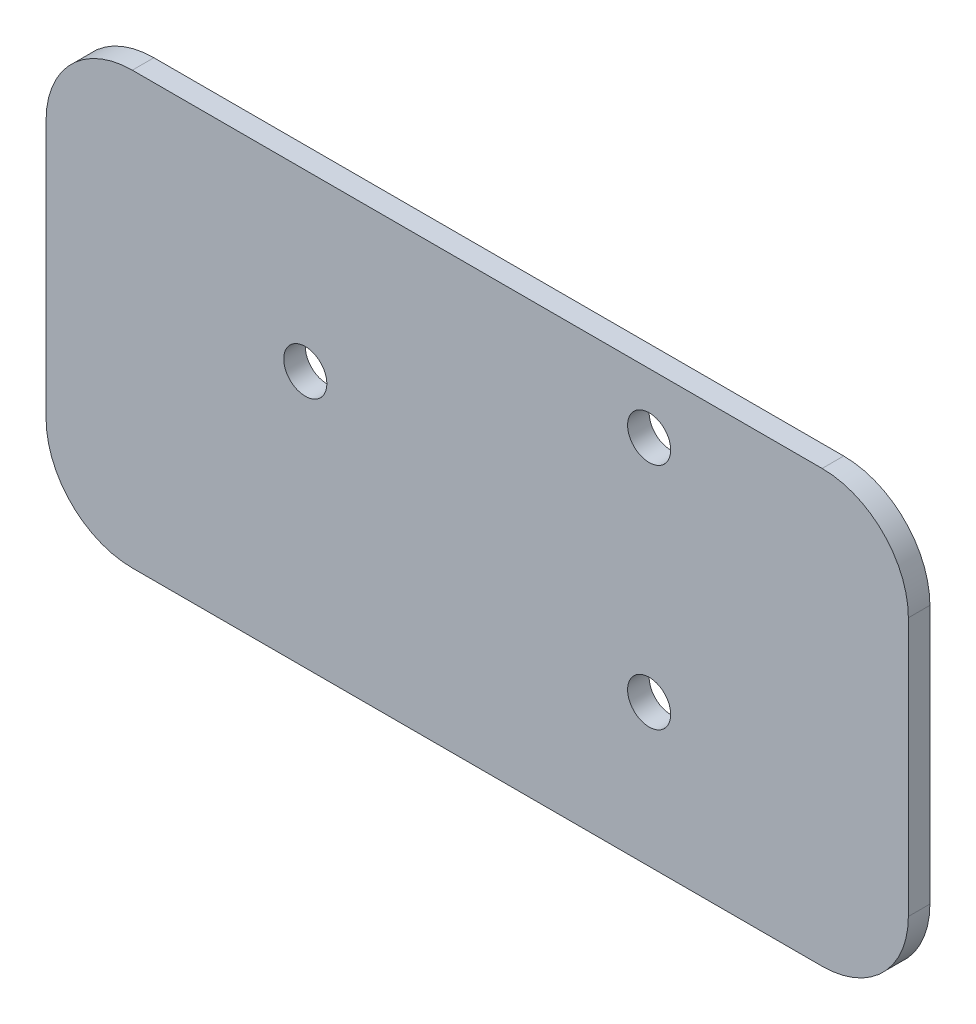
ISO-10303-21;
HEADER;
FILE_DESCRIPTION(('STEP AP214'),'2;1');
FILE_NAME('part.step','',(''),(''),'','','');
FILE_SCHEMA(('AUTOMOTIVE_DESIGN { 1 0 10303 214 1 1 1 1 }'));
ENDSEC;
DATA;
#1=APPLICATION_CONTEXT('core data for automotive mechanical design processes');
#2=APPLICATION_PROTOCOL_DEFINITION('international standard','automotive_design',2000,#1);
#3=PRODUCT_CONTEXT('',#1,'mechanical');
#4=PRODUCT('Part','Part','',(#3));
#5=PRODUCT_RELATED_PRODUCT_CATEGORY('part','',(#4));
#6=PRODUCT_DEFINITION_FORMATION('','',#4);
#7=PRODUCT_DEFINITION_CONTEXT('part definition',#1,'design');
#8=PRODUCT_DEFINITION('design','',#6,#7);
#9=PRODUCT_DEFINITION_SHAPE('','',#8);
#10=(LENGTH_UNIT() NAMED_UNIT(*) SI_UNIT(.MILLI.,.METRE.));
#11=(NAMED_UNIT(*) PLANE_ANGLE_UNIT() SI_UNIT($,.RADIAN.));
#12=(NAMED_UNIT(*) SI_UNIT($,.STERADIAN.) SOLID_ANGLE_UNIT());
#13=UNCERTAINTY_MEASURE_WITH_UNIT(LENGTH_MEASURE(1.E-05),#10,'distance_accuracy_value','');
#14=(GEOMETRIC_REPRESENTATION_CONTEXT(3) GLOBAL_UNCERTAINTY_ASSIGNED_CONTEXT((#13)) GLOBAL_UNIT_ASSIGNED_CONTEXT((#10,
#11,#12)) REPRESENTATION_CONTEXT('',''));
#15=CARTESIAN_POINT('',(0.,0.,0.));
#16=DIRECTION('',(0.,0.,1.));
#17=DIRECTION('',(1.,0.,0.));
#18=AXIS2_PLACEMENT_3D('',#15,#16,#17);
#19=CARTESIAN_POINT('',(0.,139.055716341249,3.175));
#20=DIRECTION('',(0.,1.,0.));
#21=DIRECTION('',(0.,0.,1.));
#22=AXIS2_PLACEMENT_3D('',#19,#20,#21);
#23=PLANE('',#22);
#24=DIRECTION('',(1.,0.,0.));
#25=VECTOR('',#24,1.);
#26=CARTESIAN_POINT('',(0.,139.055716341249,0.));
#27=LINE('',#26,#25);
#28=CARTESIAN_POINT('',(409.779351392055,139.055716341249,0.));
#29=VERTEX_POINT('',#28);
#30=CARTESIAN_POINT('',(511.379351392055,139.055716341249,0.));
#31=VERTEX_POINT('',#30);
#32=EDGE_CURVE('E139',#29,#31,#27,.T.);
#33=ORIENTED_EDGE('',*,*,#32,.F.);
#34=DIRECTION('',(0.,0.,-1.));
#35=VECTOR('',#34,1.);
#36=CARTESIAN_POINT('',(409.779351392055,139.055716341249,3.175));
#37=LINE('',#36,#35);
#38=CARTESIAN_POINT('',(409.779351392055,139.055716341249,3.175));
#39=VERTEX_POINT('',#38);
#40=EDGE_CURVE('E11',#39,#29,#37,.T.);
#41=ORIENTED_EDGE('',*,*,#40,.F.);
#42=DIRECTION('',(1.,0.,0.));
#43=VECTOR('',#42,1.);
#44=CARTESIAN_POINT('',(0.,139.055716341249,3.175));
#45=LINE('',#44,#43);
#46=CARTESIAN_POINT('',(511.379351392055,139.055716341249,3.175));
#47=VERTEX_POINT('',#46);
#48=EDGE_CURVE('E311',#39,#47,#45,.T.);
#49=ORIENTED_EDGE('',*,*,#48,.T.);
#50=DIRECTION('',(0.,0.,-1.));
#51=VECTOR('',#50,1.);
#52=CARTESIAN_POINT('',(511.379351392055,139.055716341249,3.175));
#53=LINE('',#52,#51);
#54=EDGE_CURVE('E53',#47,#31,#53,.T.);
#55=ORIENTED_EDGE('',*,*,#54,.T.);
#56=EDGE_LOOP('',(#33,#41,#49,#55));
#57=FACE_BOUND('',#56,.T.);
#58=ADVANCED_FACE('F36',(#57),#23,.T.);
#59=CARTESIAN_POINT('',(409.779351392055,126.355716341249,3.175));
#60=DIRECTION('',(0.,0.,-1.));
#61=DIRECTION('',(-1.,0.,0.));
#62=AXIS2_PLACEMENT_3D('',#59,#60,#61);
#63=CYLINDRICAL_SURFACE('',#62,12.7);
#64=CARTESIAN_POINT('',(409.779351392055,126.355716341249,0.));
#65=DIRECTION('',(0.,0.,1.));
#66=DIRECTION('',(1.,0.,0.));
#67=AXIS2_PLACEMENT_3D('',#64,#65,#66);
#68=CIRCLE('',#67,12.7);
#69=CARTESIAN_POINT('',(397.079351392055,126.355716341249,0.));
#70=VERTEX_POINT('',#69);
#71=EDGE_CURVE('E141',#29,#70,#68,.T.);
#72=ORIENTED_EDGE('',*,*,#71,.T.);
#73=DIRECTION('',(0.,0.,-1.));
#74=VECTOR('',#73,1.);
#75=CARTESIAN_POINT('',(397.079351392055,126.355716341249,3.175));
#76=LINE('',#75,#74);
#77=CARTESIAN_POINT('',(397.079351392055,126.355716341249,3.175));
#78=VERTEX_POINT('',#77);
#79=EDGE_CURVE('E45',#78,#70,#76,.T.);
#80=ORIENTED_EDGE('',*,*,#79,.F.);
#81=CARTESIAN_POINT('',(409.779351392055,126.355716341249,3.175));
#82=DIRECTION('',(0.,0.,1.));
#83=DIRECTION('',(1.,0.,0.));
#84=AXIS2_PLACEMENT_3D('',#81,#82,#83);
#85=CIRCLE('',#84,12.7);
#86=EDGE_CURVE('E307',#39,#78,#85,.T.);
#87=ORIENTED_EDGE('',*,*,#86,.F.);
#88=ORIENTED_EDGE('',*,*,#40,.T.);
#89=EDGE_LOOP('',(#72,#80,#87,#88));
#90=FACE_BOUND('',#89,.T.);
#91=ADVANCED_FACE('F178',(#90),#63,.T.);
#92=CARTESIAN_POINT('',(397.079351392055,5.78538895693811E-13,3.175));
#93=DIRECTION('',(1.,0.,0.));
#94=DIRECTION('',(0.,1.,0.));
#95=AXIS2_PLACEMENT_3D('',#92,#93,#94);
#96=PLANE('',#95);
#97=DIRECTION('',(0.,-1.,0.));
#98=VECTOR('',#97,1.);
#99=CARTESIAN_POINT('',(397.079351392055,5.78538895693811E-13,0.));
#100=LINE('',#99,#98);
#101=CARTESIAN_POINT('',(397.079351392055,88.2557163412488,0.));
#102=VERTEX_POINT('',#101);
#103=EDGE_CURVE('E144',#70,#102,#100,.T.);
#104=ORIENTED_EDGE('',*,*,#103,.T.);
#105=DIRECTION('',(0.,0.,-1.));
#106=VECTOR('',#105,1.);
#107=CARTESIAN_POINT('',(397.079351392055,88.2557163412488,3.175));
#108=LINE('',#107,#106);
#109=CARTESIAN_POINT('',(397.079351392055,88.2557163412488,3.175));
#110=VERTEX_POINT('',#109);
#111=EDGE_CURVE('E166',#110,#102,#108,.T.);
#112=ORIENTED_EDGE('',*,*,#111,.F.);
#113=DIRECTION('',(0.,-1.,0.));
#114=VECTOR('',#113,1.);
#115=CARTESIAN_POINT('',(397.079351392055,5.78538895693811E-13,3.175));
#116=LINE('',#115,#114);
#117=EDGE_CURVE('E174',#78,#110,#116,.T.);
#118=ORIENTED_EDGE('',*,*,#117,.F.);
#119=ORIENTED_EDGE('',*,*,#79,.T.);
#120=EDGE_LOOP('',(#104,#112,#118,#119));
#121=FACE_BOUND('',#120,.T.);
#122=ADVANCED_FACE('F171',(#121),#96,.F.);
#123=CARTESIAN_POINT('',(409.779351392055,88.2557163412488,3.175));
#124=DIRECTION('',(0.,0.,-1.));
#125=DIRECTION('',(-1.,0.,0.));
#126=AXIS2_PLACEMENT_3D('',#123,#124,#125);
#127=CYLINDRICAL_SURFACE('',#126,12.7);
#128=CARTESIAN_POINT('',(409.779351392055,88.2557163412488,0.));
#129=DIRECTION('',(0.,0.,1.));
#130=DIRECTION('',(1.,0.,0.));
#131=AXIS2_PLACEMENT_3D('',#128,#129,#130);
#132=CIRCLE('',#131,12.7);
#133=CARTESIAN_POINT('',(409.779351392055,75.5557163412488,0.));
#134=VERTEX_POINT('',#133);
#135=EDGE_CURVE('E147',#102,#134,#132,.T.);
#136=ORIENTED_EDGE('',*,*,#135,.T.);
#137=DIRECTION('',(0.,0.,-1.));
#138=VECTOR('',#137,1.);
#139=CARTESIAN_POINT('',(409.779351392055,75.5557163412488,3.175));
#140=LINE('',#139,#138);
#141=CARTESIAN_POINT('',(409.779351392055,75.5557163412488,3.175));
#142=VERTEX_POINT('',#141);
#143=EDGE_CURVE('E163',#142,#134,#140,.T.);
#144=ORIENTED_EDGE('',*,*,#143,.F.);
#145=CARTESIAN_POINT('',(409.779351392055,88.2557163412488,3.175));
#146=DIRECTION('',(0.,0.,1.));
#147=DIRECTION('',(1.,0.,0.));
#148=AXIS2_PLACEMENT_3D('',#145,#146,#147);
#149=CIRCLE('',#148,12.7);
#150=EDGE_CURVE('E305',#110,#142,#149,.T.);
#151=ORIENTED_EDGE('',*,*,#150,.F.);
#152=ORIENTED_EDGE('',*,*,#111,.T.);
#153=EDGE_LOOP('',(#136,#144,#151,#152));
#154=FACE_BOUND('',#153,.T.);
#155=ADVANCED_FACE('F227',(#154),#127,.T.);
#156=CARTESIAN_POINT('',(0.,75.5557163412487,3.175));
#157=DIRECTION('',(0.,1.,0.));
#158=DIRECTION('',(-1.,0.,0.));
#159=AXIS2_PLACEMENT_3D('',#156,#157,#158);
#160=PLANE('',#159);
#161=DIRECTION('',(1.,0.,0.));
#162=VECTOR('',#161,1.);
#163=CARTESIAN_POINT('',(0.,75.5557163412487,0.));
#164=LINE('',#163,#162);
#165=CARTESIAN_POINT('',(511.379351392055,75.5557163412488,0.));
#166=VERTEX_POINT('',#165);
#167=EDGE_CURVE('E150',#134,#166,#164,.T.);
#168=ORIENTED_EDGE('',*,*,#167,.T.);
#169=DIRECTION('',(0.,0.,-1.));
#170=VECTOR('',#169,1.);
#171=CARTESIAN_POINT('',(511.379351392055,75.5557163412488,3.175));
#172=LINE('',#171,#170);
#173=CARTESIAN_POINT('',(511.379351392055,75.5557163412488,3.175));
#174=VERTEX_POINT('',#173);
#175=EDGE_CURVE('E122',#174,#166,#172,.T.);
#176=ORIENTED_EDGE('',*,*,#175,.F.);
#177=DIRECTION('',(1.,0.,0.));
#178=VECTOR('',#177,1.);
#179=CARTESIAN_POINT('',(0.,75.5557163412487,3.175));
#180=LINE('',#179,#178);
#181=EDGE_CURVE('E111',#142,#174,#180,.T.);
#182=ORIENTED_EDGE('',*,*,#181,.F.);
#183=ORIENTED_EDGE('',*,*,#143,.T.);
#184=EDGE_LOOP('',(#168,#176,#182,#183));
#185=FACE_BOUND('',#184,.T.);
#186=ADVANCED_FACE('F224',(#185),#160,.F.);
#187=CARTESIAN_POINT('',(511.379351392055,88.2557163412488,3.175));
#188=DIRECTION('',(0.,0.,-1.));
#189=DIRECTION('',(-1.,0.,0.));
#190=AXIS2_PLACEMENT_3D('',#187,#188,#189);
#191=CYLINDRICAL_SURFACE('',#190,12.7);
#192=CARTESIAN_POINT('',(511.379351392055,88.2557163412488,0.));
#193=DIRECTION('',(0.,0.,1.));
#194=DIRECTION('',(1.,0.,0.));
#195=AXIS2_PLACEMENT_3D('',#192,#193,#194);
#196=CIRCLE('',#195,12.7);
#197=CARTESIAN_POINT('',(524.079351392055,88.2557163412488,0.));
#198=VERTEX_POINT('',#197);
#199=EDGE_CURVE('E119',#166,#198,#196,.T.);
#200=ORIENTED_EDGE('',*,*,#199,.T.);
#201=DIRECTION('',(0.,0.,-1.));
#202=VECTOR('',#201,1.);
#203=CARTESIAN_POINT('',(524.079351392055,88.2557163412488,3.175));
#204=LINE('',#203,#202);
#205=CARTESIAN_POINT('',(524.079351392055,88.2557163412488,3.175));
#206=VERTEX_POINT('',#205);
#207=EDGE_CURVE('E117',#206,#198,#204,.T.);
#208=ORIENTED_EDGE('',*,*,#207,.F.);
#209=CARTESIAN_POINT('',(511.379351392055,88.2557163412488,3.175));
#210=DIRECTION('',(0.,0.,1.));
#211=DIRECTION('',(1.,0.,0.));
#212=AXIS2_PLACEMENT_3D('',#209,#210,#211);
#213=CIRCLE('',#212,12.7);
#214=EDGE_CURVE('E103',#174,#206,#213,.T.);
#215=ORIENTED_EDGE('',*,*,#214,.F.);
#216=ORIENTED_EDGE('',*,*,#175,.T.);
#217=EDGE_LOOP('',(#200,#208,#215,#216));
#218=FACE_BOUND('',#217,.T.);
#219=ADVANCED_FACE('F118',(#218),#191,.T.);
#220=CARTESIAN_POINT('',(524.079351392055,0.,3.175));
#221=DIRECTION('',(1.,0.,0.));
#222=DIRECTION('',(0.,0.,-1.));
#223=AXIS2_PLACEMENT_3D('',#220,#221,#222);
#224=PLANE('',#223);
#225=DIRECTION('',(0.,-1.,0.));
#226=VECTOR('',#225,1.);
#227=CARTESIAN_POINT('',(524.079351392055,0.,0.));
#228=LINE('',#227,#226);
#229=CARTESIAN_POINT('',(524.079351392055,126.355716341249,0.));
#230=VERTEX_POINT('',#229);
#231=EDGE_CURVE('E154',#230,#198,#228,.T.);
#232=ORIENTED_EDGE('',*,*,#231,.F.);
#233=DIRECTION('',(0.,0.,-1.));
#234=VECTOR('',#233,1.);
#235=CARTESIAN_POINT('',(524.079351392055,126.355716341249,3.175));
#236=LINE('',#235,#234);
#237=CARTESIAN_POINT('',(524.079351392055,126.355716341249,3.175));
#238=VERTEX_POINT('',#237);
#239=EDGE_CURVE('E78',#238,#230,#236,.T.);
#240=ORIENTED_EDGE('',*,*,#239,.F.);
#241=DIRECTION('',(0.,-1.,0.));
#242=VECTOR('',#241,1.);
#243=CARTESIAN_POINT('',(524.079351392055,0.,3.175));
#244=LINE('',#243,#242);
#245=EDGE_CURVE('E109',#238,#206,#244,.T.);
#246=ORIENTED_EDGE('',*,*,#245,.T.);
#247=ORIENTED_EDGE('',*,*,#207,.T.);
#248=EDGE_LOOP('',(#232,#240,#246,#247));
#249=FACE_BOUND('',#248,.T.);
#250=ADVANCED_FACE('F124',(#249),#224,.T.);
#251=CARTESIAN_POINT('',(435.255534848016,113.379343598158,3.175));
#252=DIRECTION('',(0.,0.,-1.));
#253=DIRECTION('',(-1.,0.,0.));
#254=AXIS2_PLACEMENT_3D('',#251,#252,#253);
#255=CYLINDRICAL_SURFACE('',#254,3.17500000000009);
#256=CARTESIAN_POINT('',(435.255534848016,113.379343598158,3.175));
#257=DIRECTION('',(0.,0.,1.));
#258=DIRECTION('',(1.,0.,0.));
#259=AXIS2_PLACEMENT_3D('',#256,#257,#258);
#260=CIRCLE('',#259,3.17500000000009);
#261=CARTESIAN_POINT('',(438.430534848016,113.379343598158,3.175));
#262=VERTEX_POINT('',#261);
#263=EDGE_CURVE('E313',#262,#262,#260,.T.);
#264=ORIENTED_EDGE('',*,*,#263,.T.);
#265=EDGE_LOOP('',(#264));
#266=FACE_BOUND('',#265,.T.);
#267=CARTESIAN_POINT('',(435.255534848016,113.379343598158,0.));
#268=DIRECTION('',(0.,0.,1.));
#269=DIRECTION('',(1.,0.,0.));
#270=AXIS2_PLACEMENT_3D('',#267,#268,#269);
#271=CIRCLE('',#270,3.17500000000009);
#272=CARTESIAN_POINT('',(438.430534848016,113.379343598158,0.));
#273=VERTEX_POINT('',#272);
#274=EDGE_CURVE('E136',#273,#273,#271,.T.);
#275=ORIENTED_EDGE('',*,*,#274,.F.);
#276=EDGE_LOOP('',(#275));
#277=FACE_BOUND('',#276,.T.);
#278=ADVANCED_FACE('F189',(#266,#277),#255,.F.);
#279=CARTESIAN_POINT('',(485.903167936094,96.5107163412532,3.175));
#280=DIRECTION('',(0.,0.,-1.));
#281=DIRECTION('',(-1.,0.,0.));
#282=AXIS2_PLACEMENT_3D('',#279,#280,#281);
#283=CYLINDRICAL_SURFACE('',#282,3.17500000000009);
#284=CARTESIAN_POINT('',(485.903167936094,96.5107163412532,3.175));
#285=DIRECTION('',(0.,0.,1.));
#286=DIRECTION('',(1.,0.,0.));
#287=AXIS2_PLACEMENT_3D('',#284,#285,#286);
#288=CIRCLE('',#287,3.17500000000009);
#289=CARTESIAN_POINT('',(489.078167936094,96.5107163412532,3.175));
#290=VERTEX_POINT('',#289);
#291=EDGE_CURVE('E203',#290,#290,#288,.T.);
#292=ORIENTED_EDGE('',*,*,#291,.T.);
#293=EDGE_LOOP('',(#292));
#294=FACE_BOUND('',#293,.T.);
#295=CARTESIAN_POINT('',(485.903167936094,96.5107163412532,0.));
#296=DIRECTION('',(0.,0.,1.));
#297=DIRECTION('',(1.,0.,0.));
#298=AXIS2_PLACEMENT_3D('',#295,#296,#297);
#299=CIRCLE('',#298,3.17500000000009);
#300=CARTESIAN_POINT('',(489.078167936094,96.5107163412532,0.));
#301=VERTEX_POINT('',#300);
#302=EDGE_CURVE('E133',#301,#301,#299,.T.);
#303=ORIENTED_EDGE('',*,*,#302,.F.);
#304=EDGE_LOOP('',(#303));
#305=FACE_BOUND('',#304,.T.);
#306=ADVANCED_FACE('F191',(#294,#305),#283,.F.);
#307=CARTESIAN_POINT('',(485.903167936094,130.247970855064,3.175));
#308=DIRECTION('',(0.,0.,-1.));
#309=DIRECTION('',(-1.,0.,0.));
#310=AXIS2_PLACEMENT_3D('',#307,#308,#309);
#311=CYLINDRICAL_SURFACE('',#310,3.17500000000009);
#312=CARTESIAN_POINT('',(485.903167936094,130.247970855064,3.175));
#313=DIRECTION('',(0.,0.,1.));
#314=DIRECTION('',(1.,0.,0.));
#315=AXIS2_PLACEMENT_3D('',#312,#313,#314);
#316=CIRCLE('',#315,3.17500000000009);
#317=CARTESIAN_POINT('',(489.078167936094,130.247970855064,3.175));
#318=VERTEX_POINT('',#317);
#319=EDGE_CURVE('E159',#318,#318,#316,.T.);
#320=ORIENTED_EDGE('',*,*,#319,.T.);
#321=EDGE_LOOP('',(#320));
#322=FACE_BOUND('',#321,.T.);
#323=CARTESIAN_POINT('',(485.903167936094,130.247970855064,0.));
#324=DIRECTION('',(0.,0.,1.));
#325=DIRECTION('',(1.,0.,0.));
#326=AXIS2_PLACEMENT_3D('',#323,#324,#325);
#327=CIRCLE('',#326,3.17500000000009);
#328=CARTESIAN_POINT('',(489.078167936094,130.247970855064,0.));
#329=VERTEX_POINT('',#328);
#330=EDGE_CURVE('E130',#329,#329,#327,.T.);
#331=ORIENTED_EDGE('',*,*,#330,.F.);
#332=EDGE_LOOP('',(#331));
#333=FACE_BOUND('',#332,.T.);
#334=ADVANCED_FACE('F38',(#322,#333),#311,.F.);
#335=CARTESIAN_POINT('',(511.379351392055,126.355716341249,3.175));
#336=DIRECTION('',(0.,0.,-1.));
#337=DIRECTION('',(-1.,0.,0.));
#338=AXIS2_PLACEMENT_3D('',#335,#336,#337);
#339=CYLINDRICAL_SURFACE('',#338,12.7);
#340=CARTESIAN_POINT('',(511.379351392055,126.355716341249,0.));
#341=DIRECTION('',(0.,0.,1.));
#342=DIRECTION('',(1.,0.,0.));
#343=AXIS2_PLACEMENT_3D('',#340,#341,#342);
#344=CIRCLE('',#343,12.7);
#345=EDGE_CURVE('E156',#31,#230,#344,.F.);
#346=ORIENTED_EDGE('',*,*,#345,.F.);
#347=ORIENTED_EDGE('',*,*,#54,.F.);
#348=CARTESIAN_POINT('',(511.379351392055,126.355716341249,3.175));
#349=DIRECTION('',(0.,0.,1.));
#350=DIRECTION('',(1.,0.,0.));
#351=AXIS2_PLACEMENT_3D('',#348,#349,#350);
#352=CIRCLE('',#351,12.7);
#353=EDGE_CURVE('E125',#47,#238,#352,.F.);
#354=ORIENTED_EDGE('',*,*,#353,.T.);
#355=ORIENTED_EDGE('',*,*,#239,.T.);
#356=EDGE_LOOP('',(#346,#347,#354,#355));
#357=FACE_BOUND('',#356,.T.);
#358=ADVANCED_FACE('F198',(#357),#339,.T.);
#359=CARTESIAN_POINT('',(0.,0.,3.175));
#360=DIRECTION('',(0.,0.,1.));
#361=DIRECTION('',(1.,0.,0.));
#362=AXIS2_PLACEMENT_3D('',#359,#360,#361);
#363=PLANE('',#362);
#364=ORIENTED_EDGE('',*,*,#319,.F.);
#365=EDGE_LOOP('',(#364));
#366=FACE_BOUND('',#365,.T.);
#367=ORIENTED_EDGE('',*,*,#291,.F.);
#368=EDGE_LOOP('',(#367));
#369=FACE_BOUND('',#368,.T.);
#370=ORIENTED_EDGE('',*,*,#263,.F.);
#371=EDGE_LOOP('',(#370));
#372=FACE_BOUND('',#371,.T.);
#373=ORIENTED_EDGE('',*,*,#48,.F.);
#374=ORIENTED_EDGE('',*,*,#86,.T.);
#375=ORIENTED_EDGE('',*,*,#117,.T.);
#376=ORIENTED_EDGE('',*,*,#150,.T.);
#377=ORIENTED_EDGE('',*,*,#181,.T.);
#378=ORIENTED_EDGE('',*,*,#214,.T.);
#379=ORIENTED_EDGE('',*,*,#245,.F.);
#380=ORIENTED_EDGE('',*,*,#353,.F.);
#381=EDGE_LOOP('',(#373,#374,#375,#376,#377,#378,#379,#380));
#382=FACE_BOUND('',#381,.T.);
#383=ADVANCED_FACE('F106',(#366,#369,#372,#382),#363,.T.);
#384=CARTESIAN_POINT('',(0.,0.,0.));
#385=DIRECTION('',(0.,0.,1.));
#386=DIRECTION('',(1.,0.,0.));
#387=AXIS2_PLACEMENT_3D('',#384,#385,#386);
#388=PLANE('',#387);
#389=ORIENTED_EDGE('',*,*,#330,.T.);
#390=EDGE_LOOP('',(#389));
#391=FACE_BOUND('',#390,.T.);
#392=ORIENTED_EDGE('',*,*,#302,.T.);
#393=EDGE_LOOP('',(#392));
#394=FACE_BOUND('',#393,.T.);
#395=ORIENTED_EDGE('',*,*,#274,.T.);
#396=EDGE_LOOP('',(#395));
#397=FACE_BOUND('',#396,.T.);
#398=ORIENTED_EDGE('',*,*,#32,.T.);
#399=ORIENTED_EDGE('',*,*,#345,.T.);
#400=ORIENTED_EDGE('',*,*,#231,.T.);
#401=ORIENTED_EDGE('',*,*,#199,.F.);
#402=ORIENTED_EDGE('',*,*,#167,.F.);
#403=ORIENTED_EDGE('',*,*,#135,.F.);
#404=ORIENTED_EDGE('',*,*,#103,.F.);
#405=ORIENTED_EDGE('',*,*,#71,.F.);
#406=EDGE_LOOP('',(#398,#399,#400,#401,#402,#403,#404,#405));
#407=FACE_BOUND('',#406,.T.);
#408=ADVANCED_FACE('F180',(#391,#394,#397,#407),#388,.F.);
#409=CLOSED_SHELL('',(#58,#91,#122,#155,#186,#219,#250,#278,#306,#334,#358,#383,#408));
#410=MANIFOLD_SOLID_BREP('B2',#409);
#411=ADVANCED_BREP_SHAPE_REPRESENTATION('',(#18,#410),#14);
#412=SHAPE_DEFINITION_REPRESENTATION(#9,#411);
ENDSEC;
END-ISO-10303-21;
